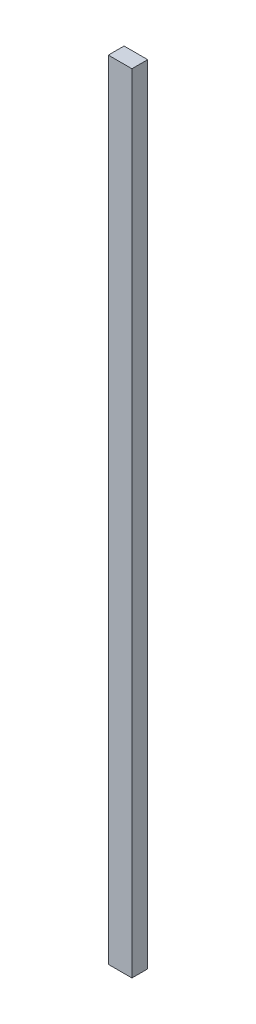
ISO-10303-21;
HEADER;
FILE_DESCRIPTION(('STEP AP214'),'2;1');
FILE_NAME('part.step','',(''),(''),'','','');
FILE_SCHEMA(('AUTOMOTIVE_DESIGN { 1 0 10303 214 1 1 1 1 }'));
ENDSEC;
DATA;
#1=APPLICATION_CONTEXT('core data for automotive mechanical design processes');
#2=APPLICATION_PROTOCOL_DEFINITION('international standard','automotive_design',2000,#1);
#3=PRODUCT_CONTEXT('',#1,'mechanical');
#4=PRODUCT('Part','Part','',(#3));
#5=PRODUCT_RELATED_PRODUCT_CATEGORY('part','',(#4));
#6=PRODUCT_DEFINITION_FORMATION('','',#4);
#7=PRODUCT_DEFINITION_CONTEXT('part definition',#1,'design');
#8=PRODUCT_DEFINITION('design','',#6,#7);
#9=PRODUCT_DEFINITION_SHAPE('','',#8);
#10=(LENGTH_UNIT() NAMED_UNIT(*) SI_UNIT(.MILLI.,.METRE.));
#11=(NAMED_UNIT(*) PLANE_ANGLE_UNIT() SI_UNIT($,.RADIAN.));
#12=(NAMED_UNIT(*) SI_UNIT($,.STERADIAN.) SOLID_ANGLE_UNIT());
#13=UNCERTAINTY_MEASURE_WITH_UNIT(LENGTH_MEASURE(1.E-05),#10,'distance_accuracy_value','');
#14=(GEOMETRIC_REPRESENTATION_CONTEXT(3) GLOBAL_UNCERTAINTY_ASSIGNED_CONTEXT((#13)) GLOBAL_UNIT_ASSIGNED_CONTEXT((#10,
#11,#12)) REPRESENTATION_CONTEXT('',''));
#15=CARTESIAN_POINT('',(0.,0.,0.));
#16=DIRECTION('',(0.,0.,1.));
#17=DIRECTION('',(1.,0.,0.));
#18=AXIS2_PLACEMENT_3D('',#15,#16,#17);
#19=CARTESIAN_POINT('',(6.,400.,4.));
#20=DIRECTION('',(-1.,0.,0.));
#21=DIRECTION('',(0.,0.,1.));
#22=AXIS2_PLACEMENT_3D('',#19,#20,#21);
#23=PLANE('',#22);
#24=DIRECTION('',(0.,0.,-1.));
#25=VECTOR('',#24,1.);
#26=CARTESIAN_POINT('',(6.,0.,4.));
#27=LINE('',#26,#25);
#28=CARTESIAN_POINT('',(6.,0.,4.));
#29=VERTEX_POINT('',#28);
#30=CARTESIAN_POINT('',(6.,0.,-4.));
#31=VERTEX_POINT('',#30);
#32=EDGE_CURVE('E97',#29,#31,#27,.T.);
#33=ORIENTED_EDGE('',*,*,#32,.T.);
#34=DIRECTION('',(0.,-1.,0.));
#35=VECTOR('',#34,1.);
#36=CARTESIAN_POINT('',(6.,400.,-4.));
#37=LINE('',#36,#35);
#38=CARTESIAN_POINT('',(6.,400.,-4.));
#39=VERTEX_POINT('',#38);
#40=EDGE_CURVE('E11',#39,#31,#37,.T.);
#41=ORIENTED_EDGE('',*,*,#40,.F.);
#42=DIRECTION('',(0.,0.,-1.));
#43=VECTOR('',#42,1.);
#44=CARTESIAN_POINT('',(6.,400.,4.));
#45=LINE('',#44,#43);
#46=CARTESIAN_POINT('',(6.,400.,4.));
#47=VERTEX_POINT('',#46);
#48=EDGE_CURVE('E85',#47,#39,#45,.T.);
#49=ORIENTED_EDGE('',*,*,#48,.F.);
#50=DIRECTION('',(0.,-1.,0.));
#51=VECTOR('',#50,1.);
#52=CARTESIAN_POINT('',(6.,400.,4.));
#53=LINE('',#52,#51);
#54=EDGE_CURVE('E93',#47,#29,#53,.T.);
#55=ORIENTED_EDGE('',*,*,#54,.T.);
#56=EDGE_LOOP('',(#33,#41,#49,#55));
#57=FACE_BOUND('',#56,.T.);
#58=ADVANCED_FACE('F34',(#57),#23,.F.);
#59=CARTESIAN_POINT('',(-6.,400.,-4.));
#60=DIRECTION('',(0.,0.,1.));
#61=DIRECTION('',(1.,0.,0.));
#62=AXIS2_PLACEMENT_3D('',#59,#60,#61);
#63=PLANE('',#62);
#64=DIRECTION('',(-1.,0.,0.));
#65=VECTOR('',#64,1.);
#66=CARTESIAN_POINT('',(-6.,0.,-4.));
#67=LINE('',#66,#65);
#68=CARTESIAN_POINT('',(-6.,0.,-4.));
#69=VERTEX_POINT('',#68);
#70=EDGE_CURVE('E89',#31,#69,#67,.T.);
#71=ORIENTED_EDGE('',*,*,#70,.T.);
#72=DIRECTION('',(0.,-1.,0.));
#73=VECTOR('',#72,1.);
#74=CARTESIAN_POINT('',(-6.,400.,-4.));
#75=LINE('',#74,#73);
#76=CARTESIAN_POINT('',(-6.,400.,-4.));
#77=VERTEX_POINT('',#76);
#78=EDGE_CURVE('E42',#77,#69,#75,.T.);
#79=ORIENTED_EDGE('',*,*,#78,.F.);
#80=DIRECTION('',(-1.,0.,0.));
#81=VECTOR('',#80,1.);
#82=CARTESIAN_POINT('',(-6.,400.,-4.));
#83=LINE('',#82,#81);
#84=EDGE_CURVE('E80',#39,#77,#83,.T.);
#85=ORIENTED_EDGE('',*,*,#84,.F.);
#86=ORIENTED_EDGE('',*,*,#40,.T.);
#87=EDGE_LOOP('',(#71,#79,#85,#86));
#88=FACE_BOUND('',#87,.T.);
#89=ADVANCED_FACE('F88',(#88),#63,.F.);
#90=CARTESIAN_POINT('',(-6.,400.,4.));
#91=DIRECTION('',(1.,0.,0.));
#92=DIRECTION('',(0.,0.,-1.));
#93=AXIS2_PLACEMENT_3D('',#90,#91,#92);
#94=PLANE('',#93);
#95=DIRECTION('',(0.,0.,1.));
#96=VECTOR('',#95,1.);
#97=CARTESIAN_POINT('',(-6.,0.,4.));
#98=LINE('',#97,#96);
#99=CARTESIAN_POINT('',(-6.,0.,4.));
#100=VERTEX_POINT('',#99);
#101=EDGE_CURVE('E67',#69,#100,#98,.T.);
#102=ORIENTED_EDGE('',*,*,#101,.T.);
#103=DIRECTION('',(0.,-1.,0.));
#104=VECTOR('',#103,1.);
#105=CARTESIAN_POINT('',(-6.,400.,4.));
#106=LINE('',#105,#104);
#107=CARTESIAN_POINT('',(-6.,400.,4.));
#108=VERTEX_POINT('',#107);
#109=EDGE_CURVE('E90',#108,#100,#106,.T.);
#110=ORIENTED_EDGE('',*,*,#109,.F.);
#111=DIRECTION('',(0.,0.,1.));
#112=VECTOR('',#111,1.);
#113=CARTESIAN_POINT('',(-6.,400.,4.));
#114=LINE('',#113,#112);
#115=EDGE_CURVE('E83',#77,#108,#114,.T.);
#116=ORIENTED_EDGE('',*,*,#115,.F.);
#117=ORIENTED_EDGE('',*,*,#78,.T.);
#118=EDGE_LOOP('',(#102,#110,#116,#117));
#119=FACE_BOUND('',#118,.T.);
#120=ADVANCED_FACE('F91',(#119),#94,.F.);
#121=CARTESIAN_POINT('',(-6.,400.,4.));
#122=DIRECTION('',(0.,0.,-1.));
#123=DIRECTION('',(-1.,0.,0.));
#124=AXIS2_PLACEMENT_3D('',#121,#122,#123);
#125=PLANE('',#124);
#126=DIRECTION('',(1.,0.,0.));
#127=VECTOR('',#126,1.);
#128=CARTESIAN_POINT('',(-6.,0.,4.));
#129=LINE('',#128,#127);
#130=EDGE_CURVE('E73',#100,#29,#129,.T.);
#131=ORIENTED_EDGE('',*,*,#130,.T.);
#132=ORIENTED_EDGE('',*,*,#54,.F.);
#133=DIRECTION('',(1.,0.,0.));
#134=VECTOR('',#133,1.);
#135=CARTESIAN_POINT('',(-6.,400.,4.));
#136=LINE('',#135,#134);
#137=EDGE_CURVE('E50',#108,#47,#136,.T.);
#138=ORIENTED_EDGE('',*,*,#137,.F.);
#139=ORIENTED_EDGE('',*,*,#109,.T.);
#140=EDGE_LOOP('',(#131,#132,#138,#139));
#141=FACE_BOUND('',#140,.T.);
#142=ADVANCED_FACE('F104',(#141),#125,.F.);
#143=CARTESIAN_POINT('',(0.,400.,0.));
#144=DIRECTION('',(0.,-1.,0.));
#145=DIRECTION('',(0.,0.,-1.));
#146=AXIS2_PLACEMENT_3D('',#143,#144,#145);
#147=PLANE('',#146);
#148=ORIENTED_EDGE('',*,*,#48,.T.);
#149=ORIENTED_EDGE('',*,*,#84,.T.);
#150=ORIENTED_EDGE('',*,*,#115,.T.);
#151=ORIENTED_EDGE('',*,*,#137,.T.);
#152=EDGE_LOOP('',(#148,#149,#150,#151));
#153=FACE_BOUND('',#152,.T.);
#154=ADVANCED_FACE('F81',(#153),#147,.F.);
#155=CARTESIAN_POINT('',(0.,0.,0.));
#156=DIRECTION('',(0.,-1.,0.));
#157=DIRECTION('',(0.,0.,-1.));
#158=AXIS2_PLACEMENT_3D('',#155,#156,#157);
#159=PLANE('',#158);
#160=ORIENTED_EDGE('',*,*,#32,.F.);
#161=ORIENTED_EDGE('',*,*,#130,.F.);
#162=ORIENTED_EDGE('',*,*,#101,.F.);
#163=ORIENTED_EDGE('',*,*,#70,.F.);
#164=EDGE_LOOP('',(#160,#161,#162,#163));
#165=FACE_BOUND('',#164,.T.);
#166=ADVANCED_FACE('F107',(#165),#159,.T.);
#167=CLOSED_SHELL('',(#58,#89,#120,#142,#154,#166));
#168=MANIFOLD_SOLID_BREP('B2',#167);
#169=ADVANCED_BREP_SHAPE_REPRESENTATION('',(#18,#168),#14);
#170=SHAPE_DEFINITION_REPRESENTATION(#9,#169);
ENDSEC;
END-ISO-10303-21;
